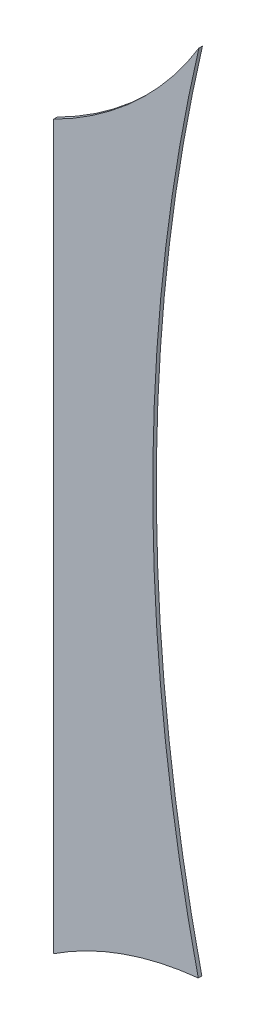
ISO-10303-21;
HEADER;
FILE_DESCRIPTION(('STEP AP214'),'2;1');
FILE_NAME('part.step','',(''),(''),'','','');
FILE_SCHEMA(('AUTOMOTIVE_DESIGN { 1 0 10303 214 1 1 1 1 }'));
ENDSEC;
DATA;
#1=APPLICATION_CONTEXT('core data for automotive mechanical design processes');
#2=APPLICATION_PROTOCOL_DEFINITION('international standard','automotive_design',2000,#1);
#3=PRODUCT_CONTEXT('',#1,'mechanical');
#4=PRODUCT('Part','Part','',(#3));
#5=PRODUCT_RELATED_PRODUCT_CATEGORY('part','',(#4));
#6=PRODUCT_DEFINITION_FORMATION('','',#4);
#7=PRODUCT_DEFINITION_CONTEXT('part definition',#1,'design');
#8=PRODUCT_DEFINITION('design','',#6,#7);
#9=PRODUCT_DEFINITION_SHAPE('','',#8);
#10=(LENGTH_UNIT() NAMED_UNIT(*) SI_UNIT(.MILLI.,.METRE.));
#11=(NAMED_UNIT(*) PLANE_ANGLE_UNIT() SI_UNIT($,.RADIAN.));
#12=(NAMED_UNIT(*) SI_UNIT($,.STERADIAN.) SOLID_ANGLE_UNIT());
#13=UNCERTAINTY_MEASURE_WITH_UNIT(LENGTH_MEASURE(1.E-05),#10,'distance_accuracy_value','');
#14=(GEOMETRIC_REPRESENTATION_CONTEXT(3) GLOBAL_UNCERTAINTY_ASSIGNED_CONTEXT((#13)) GLOBAL_UNIT_ASSIGNED_CONTEXT((#10,
#11,#12)) REPRESENTATION_CONTEXT('',''));
#15=CARTESIAN_POINT('',(0.,0.,0.));
#16=DIRECTION('',(0.,0.,1.));
#17=DIRECTION('',(1.,0.,0.));
#18=AXIS2_PLACEMENT_3D('',#15,#16,#17);
#19=CARTESIAN_POINT('',(106.060619978678,4.99427824811752,0.1));
#20=DIRECTION('',(0.,0.,-1.));
#21=DIRECTION('',(-1.,0.,0.));
#22=AXIS2_PLACEMENT_3D('',#19,#20,#21);
#23=CYLINDRICAL_SURFACE('',#22,50.1573360676653);
#24=CARTESIAN_POINT('',(106.060619978678,4.99427824811752,0.));
#25=DIRECTION('',(0.,0.,-1.));
#26=DIRECTION('',(1.,0.,0.));
#27=AXIS2_PLACEMENT_3D('',#24,#25,#26);
#28=CIRCLE('',#27,50.1573360676653);
#29=CARTESIAN_POINT('',(57.1746432653183,-6.22711391977292,0.));
#30=VERTEX_POINT('',#29);
#31=CARTESIAN_POINT('',(57.1929931122991,16.2953138578793,0.));
#32=VERTEX_POINT('',#31);
#33=EDGE_CURVE('E96',#30,#32,#28,.T.);
#34=ORIENTED_EDGE('',*,*,#33,.T.);
#35=DIRECTION('',(0.,0.,-1.));
#36=VECTOR('',#35,1.);
#37=CARTESIAN_POINT('',(57.1929931122991,16.2953138578793,0.1));
#38=LINE('',#37,#36);
#39=CARTESIAN_POINT('',(57.1929931122991,16.2953138578793,0.1));
#40=VERTEX_POINT('',#39);
#41=EDGE_CURVE('E11',#40,#32,#38,.T.);
#42=ORIENTED_EDGE('',*,*,#41,.F.);
#43=CARTESIAN_POINT('',(106.060619978678,4.99427824811752,0.1));
#44=DIRECTION('',(0.,0.,-1.));
#45=DIRECTION('',(1.,0.,0.));
#46=AXIS2_PLACEMENT_3D('',#43,#44,#45);
#47=CIRCLE('',#46,50.1573360676653);
#48=CARTESIAN_POINT('',(57.1746432653183,-6.22711391977292,0.1));
#49=VERTEX_POINT('',#48);
#50=EDGE_CURVE('E84',#49,#40,#47,.T.);
#51=ORIENTED_EDGE('',*,*,#50,.F.);
#52=DIRECTION('',(0.,0.,-1.));
#53=VECTOR('',#52,1.);
#54=CARTESIAN_POINT('',(57.1746432653183,-6.22711391977292,0.1));
#55=LINE('',#54,#53);
#56=EDGE_CURVE('E92',#49,#30,#55,.T.);
#57=ORIENTED_EDGE('',*,*,#56,.T.);
#58=EDGE_LOOP('',(#34,#42,#51,#57));
#59=FACE_BOUND('',#58,.T.);
#60=ADVANCED_FACE('F33',(#59),#23,.F.);
#61=CARTESIAN_POINT('',(48.6337499224287,21.4846691065591,0.1));
#62=DIRECTION('',(0.,0.,-1.));
#63=DIRECTION('',(-1.,0.,0.));
#64=AXIS2_PLACEMENT_3D('',#61,#62,#63);
#65=CYLINDRICAL_SURFACE('',#64,10.0094980833378);
#66=CARTESIAN_POINT('',(48.6337499224287,21.4846691065591,0.));
#67=DIRECTION('',(0.,0.,-1.));
#68=DIRECTION('',(1.,0.,0.));
#69=AXIS2_PLACEMENT_3D('',#66,#67,#68);
#70=CIRCLE('',#69,10.0094980833378);
#71=CARTESIAN_POINT('',(53.1287989064783,12.5412588782772,0.));
#72=VERTEX_POINT('',#71);
#73=EDGE_CURVE('E88',#32,#72,#70,.T.);
#74=ORIENTED_EDGE('',*,*,#73,.T.);
#75=DIRECTION('',(0.,0.,-1.));
#76=VECTOR('',#75,1.);
#77=CARTESIAN_POINT('',(53.1287989064783,12.5412588782772,0.1));
#78=LINE('',#77,#76);
#79=CARTESIAN_POINT('',(53.1287989064783,12.5412588782772,0.1));
#80=VERTEX_POINT('',#79);
#81=EDGE_CURVE('E41',#80,#72,#78,.T.);
#82=ORIENTED_EDGE('',*,*,#81,.F.);
#83=CARTESIAN_POINT('',(48.6337499224287,21.4846691065591,0.1));
#84=DIRECTION('',(0.,0.,-1.));
#85=DIRECTION('',(1.,0.,0.));
#86=AXIS2_PLACEMENT_3D('',#83,#84,#85);
#87=CIRCLE('',#86,10.0094980833378);
#88=EDGE_CURVE('E79',#40,#80,#87,.T.);
#89=ORIENTED_EDGE('',*,*,#88,.F.);
#90=ORIENTED_EDGE('',*,*,#41,.T.);
#91=EDGE_LOOP('',(#74,#82,#89,#90));
#92=FACE_BOUND('',#91,.T.);
#93=ADVANCED_FACE('F87',(#92),#65,.F.);
#94=CARTESIAN_POINT('',(53.1287989064783,12.5412588782772,0.1));
#95=DIRECTION('',(1.,0.,0.));
#96=DIRECTION('',(0.,0.,-1.));
#97=AXIS2_PLACEMENT_3D('',#94,#95,#96);
#98=PLANE('',#97);
#99=DIRECTION('',(0.,-1.,0.));
#100=VECTOR('',#99,1.);
#101=CARTESIAN_POINT('',(53.1287989064783,12.5412588782772,0.));
#102=LINE('',#101,#100);
#103=CARTESIAN_POINT('',(53.1287989064783,-7.66182301227062,0.));
#104=VERTEX_POINT('',#103);
#105=EDGE_CURVE('E66',#72,#104,#102,.T.);
#106=ORIENTED_EDGE('',*,*,#105,.T.);
#107=DIRECTION('',(0.,0.,-1.));
#108=VECTOR('',#107,1.);
#109=CARTESIAN_POINT('',(53.1287989064783,-7.66182301227062,0.1));
#110=LINE('',#109,#108);
#111=CARTESIAN_POINT('',(53.1287989064783,-7.66182301227062,0.1));
#112=VERTEX_POINT('',#111);
#113=EDGE_CURVE('E89',#112,#104,#110,.T.);
#114=ORIENTED_EDGE('',*,*,#113,.F.);
#115=DIRECTION('',(0.,-1.,0.));
#116=VECTOR('',#115,1.);
#117=CARTESIAN_POINT('',(53.1287989064783,12.5412588782772,0.1));
#118=LINE('',#117,#116);
#119=EDGE_CURVE('E82',#80,#112,#118,.T.);
#120=ORIENTED_EDGE('',*,*,#119,.F.);
#121=ORIENTED_EDGE('',*,*,#81,.T.);
#122=EDGE_LOOP('',(#106,#114,#120,#121));
#123=FACE_BOUND('',#122,.T.);
#124=ADVANCED_FACE('F90',(#123),#98,.F.);
#125=CARTESIAN_POINT('',(58.0733722503868,-15.1834529013722,0.1));
#126=DIRECTION('',(0.,0.,-1.));
#127=DIRECTION('',(-1.,0.,0.));
#128=AXIS2_PLACEMENT_3D('',#125,#126,#127);
#129=CYLINDRICAL_SURFACE('',#128,9.00131777807657);
#130=CARTESIAN_POINT('',(58.0733722503868,-15.1834529013722,0.));
#131=DIRECTION('',(0.,0.,-1.));
#132=DIRECTION('',(1.,0.,0.));
#133=AXIS2_PLACEMENT_3D('',#130,#131,#132);
#134=CIRCLE('',#133,9.00131777807657);
#135=EDGE_CURVE('E72',#104,#30,#134,.T.);
#136=ORIENTED_EDGE('',*,*,#135,.T.);
#137=ORIENTED_EDGE('',*,*,#56,.F.);
#138=CARTESIAN_POINT('',(58.0733722503868,-15.1834529013722,0.1));
#139=DIRECTION('',(0.,0.,-1.));
#140=DIRECTION('',(1.,0.,0.));
#141=AXIS2_PLACEMENT_3D('',#138,#139,#140);
#142=CIRCLE('',#141,9.00131777807657);
#143=EDGE_CURVE('E49',#112,#49,#142,.T.);
#144=ORIENTED_EDGE('',*,*,#143,.F.);
#145=ORIENTED_EDGE('',*,*,#113,.T.);
#146=EDGE_LOOP('',(#136,#137,#144,#145));
#147=FACE_BOUND('',#146,.T.);
#148=ADVANCED_FACE('F103',(#147),#129,.F.);
#149=CARTESIAN_POINT('',(106.060619978678,4.99427824811752,0.1));
#150=DIRECTION('',(0.,0.,1.));
#151=DIRECTION('',(1.,0.,0.));
#152=AXIS2_PLACEMENT_3D('',#149,#150,#151);
#153=PLANE('',#152);
#154=ORIENTED_EDGE('',*,*,#50,.T.);
#155=ORIENTED_EDGE('',*,*,#88,.T.);
#156=ORIENTED_EDGE('',*,*,#119,.T.);
#157=ORIENTED_EDGE('',*,*,#143,.T.);
#158=EDGE_LOOP('',(#154,#155,#156,#157));
#159=FACE_BOUND('',#158,.T.);
#160=ADVANCED_FACE('F80',(#159),#153,.T.);
#161=CARTESIAN_POINT('',(106.060619978678,4.99427824811752,0.));
#162=DIRECTION('',(0.,0.,1.));
#163=DIRECTION('',(1.,0.,0.));
#164=AXIS2_PLACEMENT_3D('',#161,#162,#163);
#165=PLANE('',#164);
#166=ORIENTED_EDGE('',*,*,#33,.F.);
#167=ORIENTED_EDGE('',*,*,#135,.F.);
#168=ORIENTED_EDGE('',*,*,#105,.F.);
#169=ORIENTED_EDGE('',*,*,#73,.F.);
#170=EDGE_LOOP('',(#166,#167,#168,#169));
#171=FACE_BOUND('',#170,.T.);
#172=ADVANCED_FACE('F106',(#171),#165,.F.);
#173=CLOSED_SHELL('',(#60,#93,#124,#148,#160,#172));
#174=MANIFOLD_SOLID_BREP('B2',#173);
#175=ADVANCED_BREP_SHAPE_REPRESENTATION('',(#18,#174),#14);
#176=SHAPE_DEFINITION_REPRESENTATION(#9,#175);
ENDSEC;
END-ISO-10303-21;
